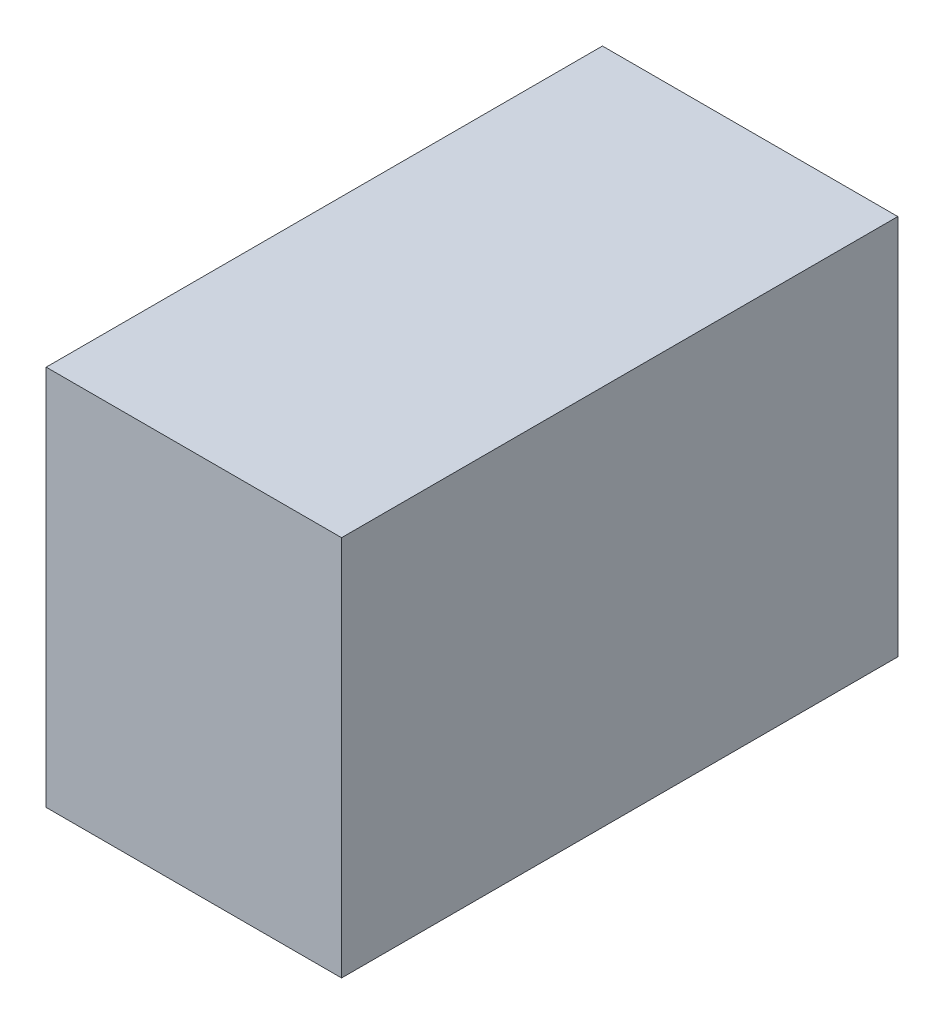
ISO-10303-21;
HEADER;
FILE_DESCRIPTION(('STEP AP214'),'2;1');
FILE_NAME('part.step','',(''),(''),'','','');
FILE_SCHEMA(('AUTOMOTIVE_DESIGN { 1 0 10303 214 1 1 1 1 }'));
ENDSEC;
DATA;
#1=APPLICATION_CONTEXT('core data for automotive mechanical design processes');
#2=APPLICATION_PROTOCOL_DEFINITION('international standard','automotive_design',2000,#1);
#3=PRODUCT_CONTEXT('',#1,'mechanical');
#4=PRODUCT('Part','Part','',(#3));
#5=PRODUCT_RELATED_PRODUCT_CATEGORY('part','',(#4));
#6=PRODUCT_DEFINITION_FORMATION('','',#4);
#7=PRODUCT_DEFINITION_CONTEXT('part definition',#1,'design');
#8=PRODUCT_DEFINITION('design','',#6,#7);
#9=PRODUCT_DEFINITION_SHAPE('','',#8);
#10=(LENGTH_UNIT() NAMED_UNIT(*) SI_UNIT(.MILLI.,.METRE.));
#11=(NAMED_UNIT(*) PLANE_ANGLE_UNIT() SI_UNIT($,.RADIAN.));
#12=(NAMED_UNIT(*) SI_UNIT($,.STERADIAN.) SOLID_ANGLE_UNIT());
#13=UNCERTAINTY_MEASURE_WITH_UNIT(LENGTH_MEASURE(1.E-05),#10,'distance_accuracy_value','');
#14=(GEOMETRIC_REPRESENTATION_CONTEXT(3) GLOBAL_UNCERTAINTY_ASSIGNED_CONTEXT((#13)) GLOBAL_UNIT_ASSIGNED_CONTEXT((#10,
#11,#12)) REPRESENTATION_CONTEXT('',''));
#15=CARTESIAN_POINT('',(0.,0.,0.));
#16=DIRECTION('',(0.,0.,1.));
#17=DIRECTION('',(1.,0.,0.));
#18=AXIS2_PLACEMENT_3D('',#15,#16,#17);
#19=CARTESIAN_POINT('',(6.21999999999999,53.841103799901,44.78));
#20=DIRECTION('',(1.,0.,0.));
#21=DIRECTION('',(0.,1.,0.));
#22=AXIS2_PLACEMENT_3D('',#19,#20,#21);
#23=PLANE('',#22);
#24=DIRECTION('',(0.,-1.,0.));
#25=VECTOR('',#24,1.);
#26=CARTESIAN_POINT('',(6.21999999999999,53.841103799901,0.));
#27=LINE('',#26,#25);
#28=CARTESIAN_POINT('',(6.21999999999999,53.841103799901,0.));
#29=VERTEX_POINT('',#28);
#30=CARTESIAN_POINT('',(6.22,23.141103799901,0.));
#31=VERTEX_POINT('',#30);
#32=EDGE_CURVE('E98',#29,#31,#27,.T.);
#33=ORIENTED_EDGE('',*,*,#32,.T.);
#34=DIRECTION('',(0.,0.,-1.));
#35=VECTOR('',#34,1.);
#36=CARTESIAN_POINT('',(6.22,23.141103799901,44.78));
#37=LINE('',#36,#35);
#38=CARTESIAN_POINT('',(6.22,23.141103799901,44.78));
#39=VERTEX_POINT('',#38);
#40=EDGE_CURVE('E11',#39,#31,#37,.T.);
#41=ORIENTED_EDGE('',*,*,#40,.F.);
#42=DIRECTION('',(0.,-1.,0.));
#43=VECTOR('',#42,1.);
#44=CARTESIAN_POINT('',(6.21999999999999,53.841103799901,44.78));
#45=LINE('',#44,#43);
#46=CARTESIAN_POINT('',(6.21999999999999,53.841103799901,44.78));
#47=VERTEX_POINT('',#46);
#48=EDGE_CURVE('E86',#47,#39,#45,.T.);
#49=ORIENTED_EDGE('',*,*,#48,.F.);
#50=DIRECTION('',(0.,0.,-1.));
#51=VECTOR('',#50,1.);
#52=CARTESIAN_POINT('',(6.21999999999999,53.841103799901,44.78));
#53=LINE('',#52,#51);
#54=EDGE_CURVE('E94',#47,#29,#53,.T.);
#55=ORIENTED_EDGE('',*,*,#54,.T.);
#56=EDGE_LOOP('',(#33,#41,#49,#55));
#57=FACE_BOUND('',#56,.T.);
#58=ADVANCED_FACE('F35',(#57),#23,.F.);
#59=CARTESIAN_POINT('',(6.22,23.141103799901,44.78));
#60=DIRECTION('',(0.,1.,0.));
#61=DIRECTION('',(0.,0.,1.));
#62=AXIS2_PLACEMENT_3D('',#59,#60,#61);
#63=PLANE('',#62);
#64=DIRECTION('',(1.,0.,0.));
#65=VECTOR('',#64,1.);
#66=CARTESIAN_POINT('',(6.22,23.141103799901,0.));
#67=LINE('',#66,#65);
#68=CARTESIAN_POINT('',(30.,23.141103799901,0.));
#69=VERTEX_POINT('',#68);
#70=EDGE_CURVE('E90',#31,#69,#67,.T.);
#71=ORIENTED_EDGE('',*,*,#70,.T.);
#72=DIRECTION('',(0.,0.,-1.));
#73=VECTOR('',#72,1.);
#74=CARTESIAN_POINT('',(30.,23.141103799901,44.78));
#75=LINE('',#74,#73);
#76=CARTESIAN_POINT('',(30.,23.141103799901,44.78));
#77=VERTEX_POINT('',#76);
#78=EDGE_CURVE('E43',#77,#69,#75,.T.);
#79=ORIENTED_EDGE('',*,*,#78,.F.);
#80=DIRECTION('',(1.,0.,0.));
#81=VECTOR('',#80,1.);
#82=CARTESIAN_POINT('',(6.22,23.141103799901,44.78));
#83=LINE('',#82,#81);
#84=EDGE_CURVE('E81',#39,#77,#83,.T.);
#85=ORIENTED_EDGE('',*,*,#84,.F.);
#86=ORIENTED_EDGE('',*,*,#40,.T.);
#87=EDGE_LOOP('',(#71,#79,#85,#86));
#88=FACE_BOUND('',#87,.T.);
#89=ADVANCED_FACE('F89',(#88),#63,.F.);
#90=CARTESIAN_POINT('',(30.,53.841103799901,44.78));
#91=DIRECTION('',(-1.,0.,0.));
#92=DIRECTION('',(0.,-1.,0.));
#93=AXIS2_PLACEMENT_3D('',#90,#91,#92);
#94=PLANE('',#93);
#95=DIRECTION('',(0.,1.,0.));
#96=VECTOR('',#95,1.);
#97=CARTESIAN_POINT('',(30.,53.841103799901,0.));
#98=LINE('',#97,#96);
#99=CARTESIAN_POINT('',(30.,53.841103799901,0.));
#100=VERTEX_POINT('',#99);
#101=EDGE_CURVE('E68',#69,#100,#98,.T.);
#102=ORIENTED_EDGE('',*,*,#101,.T.);
#103=DIRECTION('',(0.,0.,-1.));
#104=VECTOR('',#103,1.);
#105=CARTESIAN_POINT('',(30.,53.841103799901,44.78));
#106=LINE('',#105,#104);
#107=CARTESIAN_POINT('',(30.,53.841103799901,44.78));
#108=VERTEX_POINT('',#107);
#109=EDGE_CURVE('E91',#108,#100,#106,.T.);
#110=ORIENTED_EDGE('',*,*,#109,.F.);
#111=DIRECTION('',(0.,1.,0.));
#112=VECTOR('',#111,1.);
#113=CARTESIAN_POINT('',(30.,53.841103799901,44.78));
#114=LINE('',#113,#112);
#115=EDGE_CURVE('E84',#77,#108,#114,.T.);
#116=ORIENTED_EDGE('',*,*,#115,.F.);
#117=ORIENTED_EDGE('',*,*,#78,.T.);
#118=EDGE_LOOP('',(#102,#110,#116,#117));
#119=FACE_BOUND('',#118,.T.);
#120=ADVANCED_FACE('F92',(#119),#94,.F.);
#121=CARTESIAN_POINT('',(6.21999999999999,53.841103799901,44.78));
#122=DIRECTION('',(0.,-1.,0.));
#123=DIRECTION('',(0.,0.,-1.));
#124=AXIS2_PLACEMENT_3D('',#121,#122,#123);
#125=PLANE('',#124);
#126=DIRECTION('',(-1.,0.,0.));
#127=VECTOR('',#126,1.);
#128=CARTESIAN_POINT('',(6.21999999999999,53.841103799901,0.));
#129=LINE('',#128,#127);
#130=EDGE_CURVE('E74',#100,#29,#129,.T.);
#131=ORIENTED_EDGE('',*,*,#130,.T.);
#132=ORIENTED_EDGE('',*,*,#54,.F.);
#133=DIRECTION('',(-1.,0.,0.));
#134=VECTOR('',#133,1.);
#135=CARTESIAN_POINT('',(6.21999999999999,53.841103799901,44.78));
#136=LINE('',#135,#134);
#137=EDGE_CURVE('E51',#108,#47,#136,.T.);
#138=ORIENTED_EDGE('',*,*,#137,.F.);
#139=ORIENTED_EDGE('',*,*,#109,.T.);
#140=EDGE_LOOP('',(#131,#132,#138,#139));
#141=FACE_BOUND('',#140,.T.);
#142=ADVANCED_FACE('F105',(#141),#125,.F.);
#143=CARTESIAN_POINT('',(0.,0.,44.78));
#144=DIRECTION('',(0.,0.,1.));
#145=DIRECTION('',(1.,0.,0.));
#146=AXIS2_PLACEMENT_3D('',#143,#144,#145);
#147=PLANE('',#146);
#148=ORIENTED_EDGE('',*,*,#48,.T.);
#149=ORIENTED_EDGE('',*,*,#84,.T.);
#150=ORIENTED_EDGE('',*,*,#115,.T.);
#151=ORIENTED_EDGE('',*,*,#137,.T.);
#152=EDGE_LOOP('',(#148,#149,#150,#151));
#153=FACE_BOUND('',#152,.T.);
#154=ADVANCED_FACE('F82',(#153),#147,.T.);
#155=CARTESIAN_POINT('',(0.,0.,0.));
#156=DIRECTION('',(0.,0.,1.));
#157=DIRECTION('',(1.,0.,0.));
#158=AXIS2_PLACEMENT_3D('',#155,#156,#157);
#159=PLANE('',#158);
#160=ORIENTED_EDGE('',*,*,#32,.F.);
#161=ORIENTED_EDGE('',*,*,#130,.F.);
#162=ORIENTED_EDGE('',*,*,#101,.F.);
#163=ORIENTED_EDGE('',*,*,#70,.F.);
#164=EDGE_LOOP('',(#160,#161,#162,#163));
#165=FACE_BOUND('',#164,.T.);
#166=ADVANCED_FACE('F108',(#165),#159,.F.);
#167=CLOSED_SHELL('',(#58,#89,#120,#142,#154,#166));
#168=MANIFOLD_SOLID_BREP('B2',#167);
#169=ADVANCED_BREP_SHAPE_REPRESENTATION('',(#18,#168),#14);
#170=SHAPE_DEFINITION_REPRESENTATION(#9,#169);
ENDSEC;
END-ISO-10303-21;
